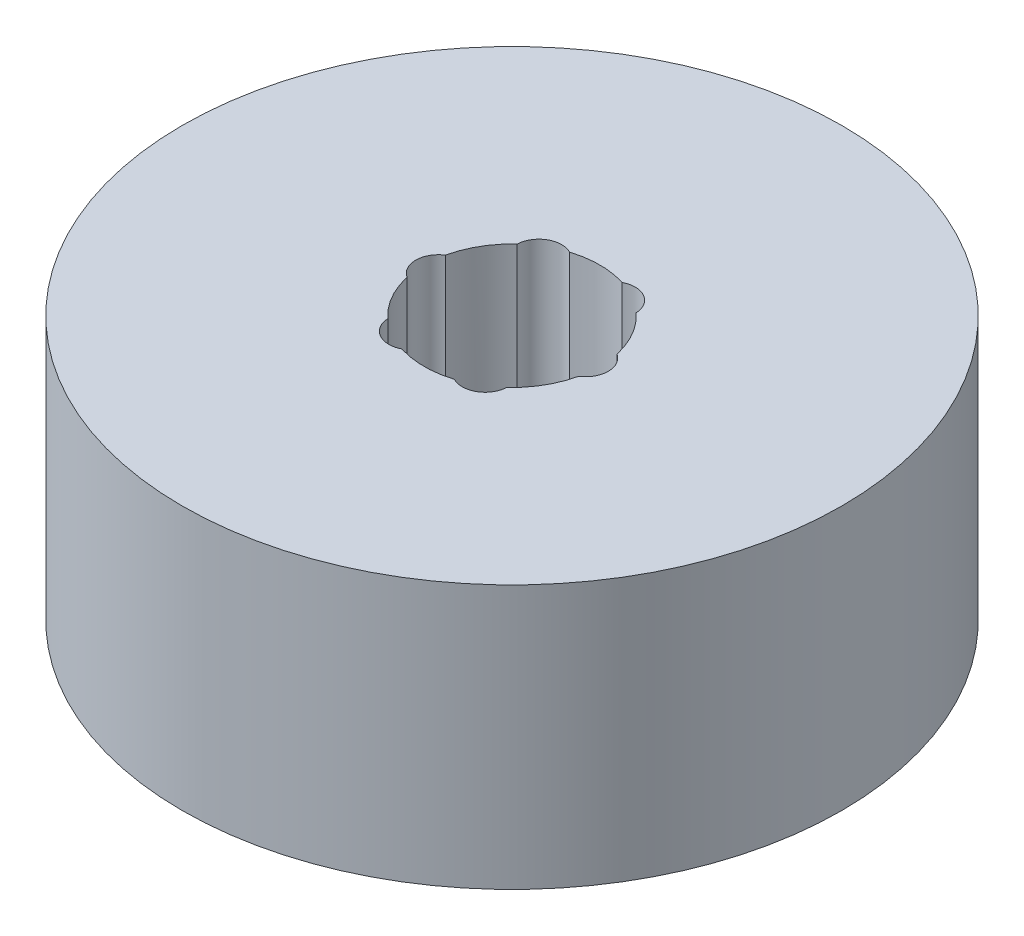
ISO-10303-21;
HEADER;
FILE_DESCRIPTION(('STEP AP214'),'2;1');
FILE_NAME('part.step','',(''),(''),'','','');
FILE_SCHEMA(('AUTOMOTIVE_DESIGN { 1 0 10303 214 1 1 1 1 }'));
ENDSEC;
DATA;
#1=APPLICATION_CONTEXT('core data for automotive mechanical design processes');
#2=APPLICATION_PROTOCOL_DEFINITION('international standard','automotive_design',2000,#1);
#3=PRODUCT_CONTEXT('',#1,'mechanical');
#4=PRODUCT('Part','Part','',(#3));
#5=PRODUCT_RELATED_PRODUCT_CATEGORY('part','',(#4));
#6=PRODUCT_DEFINITION_FORMATION('','',#4);
#7=PRODUCT_DEFINITION_CONTEXT('part definition',#1,'design');
#8=PRODUCT_DEFINITION('design','',#6,#7);
#9=PRODUCT_DEFINITION_SHAPE('','',#8);
#10=(LENGTH_UNIT() NAMED_UNIT(*) SI_UNIT(.MILLI.,.METRE.));
#11=(NAMED_UNIT(*) PLANE_ANGLE_UNIT() SI_UNIT($,.RADIAN.));
#12=(NAMED_UNIT(*) SI_UNIT($,.STERADIAN.) SOLID_ANGLE_UNIT());
#13=UNCERTAINTY_MEASURE_WITH_UNIT(LENGTH_MEASURE(1.E-05),#10,'distance_accuracy_value','');
#14=(GEOMETRIC_REPRESENTATION_CONTEXT(3) GLOBAL_UNCERTAINTY_ASSIGNED_CONTEXT((#13)) GLOBAL_UNIT_ASSIGNED_CONTEXT((#10,
#11,#12)) REPRESENTATION_CONTEXT('',''));
#15=CARTESIAN_POINT('',(0.,0.,0.));
#16=DIRECTION('',(0.,0.,1.));
#17=DIRECTION('',(1.,0.,0.));
#18=AXIS2_PLACEMENT_3D('',#15,#16,#17);
#19=CARTESIAN_POINT('',(0.,30.,0.));
#20=DIRECTION('',(0.,-1.,0.));
#21=DIRECTION('',(0.,0.,-1.));
#22=AXIS2_PLACEMENT_3D('',#19,#20,#21);
#23=CYLINDRICAL_SURFACE('',#22,37.5);
#24=CARTESIAN_POINT('',(0.,30.,0.));
#25=DIRECTION('',(0.,1.,0.));
#26=DIRECTION('',(0.,0.,1.));
#27=AXIS2_PLACEMENT_3D('',#24,#25,#26);
#28=CIRCLE('',#27,37.5);
#29=CARTESIAN_POINT('',(0.,30.,37.5));
#30=VERTEX_POINT('',#29);
#31=EDGE_CURVE('E162',#30,#30,#28,.T.);
#32=ORIENTED_EDGE('',*,*,#31,.F.);
#33=EDGE_LOOP('',(#32));
#34=FACE_BOUND('',#33,.T.);
#35=CARTESIAN_POINT('',(0.,0.,0.));
#36=DIRECTION('',(0.,1.,0.));
#37=DIRECTION('',(0.,0.,1.));
#38=AXIS2_PLACEMENT_3D('',#35,#36,#37);
#39=CIRCLE('',#38,37.5);
#40=CARTESIAN_POINT('',(0.,0.,37.5));
#41=VERTEX_POINT('',#40);
#42=EDGE_CURVE('E157',#41,#41,#39,.T.);
#43=ORIENTED_EDGE('',*,*,#42,.T.);
#44=EDGE_LOOP('',(#43));
#45=FACE_BOUND('',#44,.T.);
#46=ADVANCED_FACE('F39',(#34,#45),#23,.T.);
#47=CARTESIAN_POINT('',(0.,30.,0.));
#48=DIRECTION('',(0.,1.,0.));
#49=DIRECTION('',(0.,0.,1.));
#50=AXIS2_PLACEMENT_3D('',#47,#48,#49);
#51=PLANE('',#50);
#52=CARTESIAN_POINT('',(-4.18295327338985,30.,-7.24508759519758));
#53=DIRECTION('',(0.,1.,0.));
#54=DIRECTION('',(-0.866025403784433,0.,0.50000000000001));
#55=AXIS2_PLACEMENT_3D('',#52,#53,#54);
#56=CIRCLE('',#55,2.58696049097708);
#57=CARTESIAN_POINT('',(-2.99235889288839,30.,-9.54179166908143));
#58=VERTEX_POINT('',#57);
#59=CARTESIAN_POINT('',(-6.76725453659922,30.,-7.36235465302218));
#60=VERTEX_POINT('',#59);
#61=EDGE_CURVE('E218',#58,#60,#56,.T.);
#62=ORIENTED_EDGE('',*,*,#61,.F.);
#63=CARTESIAN_POINT('',(0.,30.,0.));
#64=DIRECTION('',(0.,1.,0.));
#65=DIRECTION('',(0.,0.,1.));
#66=AXIS2_PLACEMENT_3D('',#63,#64,#65);
#67=CIRCLE('',#66,10.);
#68=CARTESIAN_POINT('',(2.99235889288819,30.,-9.54179166908149));
#69=VERTEX_POINT('',#68);
#70=EDGE_CURVE('E169',#69,#58,#67,.T.);
#71=ORIENTED_EDGE('',*,*,#70,.F.);
#72=CARTESIAN_POINT('',(4.1829532733897,30.,-7.24508759519767));
#73=DIRECTION('',(0.,1.,0.));
#74=DIRECTION('',(-0.866025403784443,0.,-0.499999999999992));
#75=AXIS2_PLACEMENT_3D('',#72,#73,#74);
#76=CIRCLE('',#75,2.58696049097708);
#77=CARTESIAN_POINT('',(6.76725453659906,30.,-7.36235465302232));
#78=VERTEX_POINT('',#77);
#79=EDGE_CURVE('E285',#78,#69,#76,.T.);
#80=ORIENTED_EDGE('',*,*,#79,.F.);
#81=CARTESIAN_POINT('',(9.75961342948741,30.,-2.17943701605921));
#82=VERTEX_POINT('',#81);
#83=EDGE_CURVE('E174',#82,#78,#67,.T.);
#84=ORIENTED_EDGE('',*,*,#83,.F.);
#85=CARTESIAN_POINT('',(8.36590654677954,30.,0.));
#86=DIRECTION('',(0.,1.,0.));
#87=DIRECTION('',(0.,0.,-1.));
#88=AXIS2_PLACEMENT_3D('',#85,#86,#87);
#89=CIRCLE('',#88,2.58696049097708);
#90=CARTESIAN_POINT('',(9.75961342948741,30.,2.17943701605921));
#91=VERTEX_POINT('',#90);
#92=EDGE_CURVE('E280',#91,#82,#89,.T.);
#93=ORIENTED_EDGE('',*,*,#92,.F.);
#94=CARTESIAN_POINT('',(6.76725453659917,30.,7.36235465302223));
#95=VERTEX_POINT('',#94);
#96=EDGE_CURVE('E164',#95,#91,#67,.T.);
#97=ORIENTED_EDGE('',*,*,#96,.F.);
#98=CARTESIAN_POINT('',(4.1829532733898,30.,7.24508759519761));
#99=DIRECTION('',(0.,1.,0.));
#100=DIRECTION('',(0.866025403784436,0.,-0.500000000000004));
#101=AXIS2_PLACEMENT_3D('',#98,#99,#100);
#102=CIRCLE('',#101,2.58696049097708);
#103=CARTESIAN_POINT('',(2.99235889288832,30.,9.54179166908145));
#104=VERTEX_POINT('',#103);
#105=EDGE_CURVE('E269',#104,#95,#102,.T.);
#106=ORIENTED_EDGE('',*,*,#105,.F.);
#107=CARTESIAN_POINT('',(-2.99235889288825,30.,9.54179166908147));
#108=VERTEX_POINT('',#107);
#109=EDGE_CURVE('E149',#108,#104,#67,.T.);
#110=ORIENTED_EDGE('',*,*,#109,.F.);
#111=CARTESIAN_POINT('',(-4.18295327338975,30.,7.24508759519764));
#112=DIRECTION('',(0.,1.,0.));
#113=DIRECTION('',(0.86602540378444,0.,0.499999999999998));
#114=AXIS2_PLACEMENT_3D('',#111,#112,#113);
#115=CIRCLE('',#114,2.58696049097708);
#116=CARTESIAN_POINT('',(-6.76725453659911,30.,7.36235465302227));
#117=VERTEX_POINT('',#116);
#118=EDGE_CURVE('E128',#117,#108,#115,.T.);
#119=ORIENTED_EDGE('',*,*,#118,.F.);
#120=CARTESIAN_POINT('',(-9.75961342948741,30.,2.17943701605921));
#121=VERTEX_POINT('',#120);
#122=EDGE_CURVE('E148',#121,#117,#67,.T.);
#123=ORIENTED_EDGE('',*,*,#122,.F.);
#124=CARTESIAN_POINT('',(-8.36590654677954,30.,0.));
#125=DIRECTION('',(0.,1.,0.));
#126=DIRECTION('',(0.,0.,1.));
#127=AXIS2_PLACEMENT_3D('',#124,#125,#126);
#128=CIRCLE('',#127,2.58696049097708);
#129=CARTESIAN_POINT('',(-9.75961342948741,30.,-2.17943701605921));
#130=VERTEX_POINT('',#129);
#131=EDGE_CURVE('E179',#130,#121,#128,.T.);
#132=ORIENTED_EDGE('',*,*,#131,.F.);
#133=EDGE_CURVE('E161',#60,#130,#67,.T.);
#134=ORIENTED_EDGE('',*,*,#133,.F.);
#135=EDGE_LOOP('',(#62,#71,#80,#84,#93,#97,#106,#110,#119,#123,#132,#134));
#136=FACE_BOUND('',#135,.T.);
#137=ORIENTED_EDGE('',*,*,#31,.T.);
#138=EDGE_LOOP('',(#137));
#139=FACE_BOUND('',#138,.T.);
#140=ADVANCED_FACE('F141',(#136,#139),#51,.T.);
#141=CARTESIAN_POINT('',(0.,0.,0.));
#142=DIRECTION('',(0.,1.,0.));
#143=DIRECTION('',(0.,0.,1.));
#144=AXIS2_PLACEMENT_3D('',#141,#142,#143);
#145=PLANE('',#144);
#146=CARTESIAN_POINT('',(0.,0.,0.));
#147=DIRECTION('',(0.,1.,0.));
#148=DIRECTION('',(0.,0.,1.));
#149=AXIS2_PLACEMENT_3D('',#146,#147,#148);
#150=CIRCLE('',#149,10.);
#151=CARTESIAN_POINT('',(0.,0.,10.));
#152=VERTEX_POINT('',#151);
#153=EDGE_CURVE('E166',#152,#152,#150,.T.);
#154=ORIENTED_EDGE('',*,*,#153,.T.);
#155=EDGE_LOOP('',(#154));
#156=FACE_BOUND('',#155,.T.);
#157=ORIENTED_EDGE('',*,*,#42,.F.);
#158=EDGE_LOOP('',(#157));
#159=FACE_BOUND('',#158,.T.);
#160=ADVANCED_FACE('F234',(#156,#159),#145,.F.);
#161=CARTESIAN_POINT('',(0.,30.,0.));
#162=DIRECTION('',(0.,-1.,0.));
#163=DIRECTION('',(0.,0.,-1.));
#164=AXIS2_PLACEMENT_3D('',#161,#162,#163);
#165=CYLINDRICAL_SURFACE('',#164,10.);
#166=DIRECTION('',(0.,1.,0.));
#167=VECTOR('',#166,1.);
#168=CARTESIAN_POINT('',(-2.99235889288839,19.5726426997679,-9.54179166908143));
#169=LINE('',#168,#167);
#170=CARTESIAN_POINT('',(-2.99235889288839,9.14528539953572,-9.54179166908143));
#171=VERTEX_POINT('',#170);
#172=EDGE_CURVE('E11',#171,#58,#169,.T.);
#173=ORIENTED_EDGE('',*,*,#172,.F.);
#174=CARTESIAN_POINT('',(0.,9.14528539953572,0.));
#175=DIRECTION('',(0.,1.,0.));
#176=DIRECTION('',(0.,0.,1.));
#177=AXIS2_PLACEMENT_3D('',#174,#175,#176);
#178=CIRCLE('',#177,10.);
#179=CARTESIAN_POINT('',(-6.76725453659922,9.14528539953572,-7.36235465302218));
#180=VERTEX_POINT('',#179);
#181=EDGE_CURVE('E214',#171,#180,#178,.T.);
#182=ORIENTED_EDGE('',*,*,#181,.T.);
#183=DIRECTION('',(0.,1.,0.));
#184=VECTOR('',#183,1.);
#185=CARTESIAN_POINT('',(-6.76725453659922,19.5726426997679,-7.36235465302218));
#186=LINE('',#185,#184);
#187=EDGE_CURVE('E46',#60,#180,#186,.F.);
#188=ORIENTED_EDGE('',*,*,#187,.F.);
#189=ORIENTED_EDGE('',*,*,#133,.T.);
#190=DIRECTION('',(0.,1.,0.));
#191=VECTOR('',#190,1.);
#192=CARTESIAN_POINT('',(-9.75961342948741,19.5726426997679,-2.17943701605921));
#193=LINE('',#192,#191);
#194=CARTESIAN_POINT('',(-9.75961342948741,9.14528539953572,-2.17943701605921));
#195=VERTEX_POINT('',#194);
#196=EDGE_CURVE('E187',#195,#130,#193,.T.);
#197=ORIENTED_EDGE('',*,*,#196,.F.);
#198=CARTESIAN_POINT('',(0.,9.14528539953572,0.));
#199=DIRECTION('',(0.,1.,0.));
#200=DIRECTION('',(0.,0.,1.));
#201=AXIS2_PLACEMENT_3D('',#198,#199,#200);
#202=CIRCLE('',#201,10.);
#203=CARTESIAN_POINT('',(-9.75961342948741,9.14528539953572,2.17943701605921));
#204=VERTEX_POINT('',#203);
#205=EDGE_CURVE('E184',#195,#204,#202,.T.);
#206=ORIENTED_EDGE('',*,*,#205,.T.);
#207=DIRECTION('',(0.,1.,0.));
#208=VECTOR('',#207,1.);
#209=CARTESIAN_POINT('',(-9.75961342948741,19.5726426997679,2.17943701605921));
#210=LINE('',#209,#208);
#211=EDGE_CURVE('E158',#121,#204,#210,.F.);
#212=ORIENTED_EDGE('',*,*,#211,.F.);
#213=ORIENTED_EDGE('',*,*,#122,.T.);
#214=DIRECTION('',(0.,1.,0.));
#215=VECTOR('',#214,1.);
#216=CARTESIAN_POINT('',(-6.76725453659911,19.5726426997679,7.36235465302228));
#217=LINE('',#216,#215);
#218=CARTESIAN_POINT('',(-6.76725453659911,9.14528539953572,7.36235465302227));
#219=VERTEX_POINT('',#218);
#220=EDGE_CURVE('E127',#219,#117,#217,.T.);
#221=ORIENTED_EDGE('',*,*,#220,.F.);
#222=CARTESIAN_POINT('',(0.,9.14528539953572,0.));
#223=DIRECTION('',(0.,1.,0.));
#224=DIRECTION('',(0.,0.,1.));
#225=AXIS2_PLACEMENT_3D('',#222,#223,#224);
#226=CIRCLE('',#225,10.);
#227=CARTESIAN_POINT('',(-2.99235889288825,9.14528539953572,9.54179166908147));
#228=VERTEX_POINT('',#227);
#229=EDGE_CURVE('E189',#219,#228,#226,.T.);
#230=ORIENTED_EDGE('',*,*,#229,.T.);
#231=DIRECTION('',(0.,1.,0.));
#232=VECTOR('',#231,1.);
#233=CARTESIAN_POINT('',(-2.99235889288826,19.5726426997679,9.54179166908147));
#234=LINE('',#233,#232);
#235=EDGE_CURVE('E140',#108,#228,#234,.F.);
#236=ORIENTED_EDGE('',*,*,#235,.F.);
#237=ORIENTED_EDGE('',*,*,#109,.T.);
#238=DIRECTION('',(0.,1.,0.));
#239=VECTOR('',#238,1.);
#240=CARTESIAN_POINT('',(2.99235889288832,19.5726426997679,9.54179166908146));
#241=LINE('',#240,#239);
#242=CARTESIAN_POINT('',(2.99235889288832,9.14528539953572,9.54179166908145));
#243=VERTEX_POINT('',#242);
#244=EDGE_CURVE('E196',#243,#104,#241,.T.);
#245=ORIENTED_EDGE('',*,*,#244,.F.);
#246=CARTESIAN_POINT('',(0.,9.14528539953572,0.));
#247=DIRECTION('',(0.,1.,0.));
#248=DIRECTION('',(0.,0.,1.));
#249=AXIS2_PLACEMENT_3D('',#246,#247,#248);
#250=CIRCLE('',#249,10.);
#251=CARTESIAN_POINT('',(6.76725453659917,9.14528539953572,7.36235465302223));
#252=VERTEX_POINT('',#251);
#253=EDGE_CURVE('E136',#243,#252,#250,.T.);
#254=ORIENTED_EDGE('',*,*,#253,.T.);
#255=DIRECTION('',(0.,1.,0.));
#256=VECTOR('',#255,1.);
#257=CARTESIAN_POINT('',(6.76725453659917,19.5726426997679,7.36235465302223));
#258=LINE('',#257,#256);
#259=EDGE_CURVE('E194',#95,#252,#258,.F.);
#260=ORIENTED_EDGE('',*,*,#259,.F.);
#261=ORIENTED_EDGE('',*,*,#96,.T.);
#262=DIRECTION('',(0.,1.,0.));
#263=VECTOR('',#262,1.);
#264=CARTESIAN_POINT('',(9.75961342948741,19.5726426997679,2.17943701605921));
#265=LINE('',#264,#263);
#266=CARTESIAN_POINT('',(9.75961342948741,9.14528539953572,2.17943701605921));
#267=VERTEX_POINT('',#266);
#268=EDGE_CURVE('E206',#267,#91,#265,.T.);
#269=ORIENTED_EDGE('',*,*,#268,.F.);
#270=CARTESIAN_POINT('',(0.,9.14528539953572,0.));
#271=DIRECTION('',(0.,1.,0.));
#272=DIRECTION('',(0.,0.,1.));
#273=AXIS2_PLACEMENT_3D('',#270,#271,#272);
#274=CIRCLE('',#273,10.);
#275=CARTESIAN_POINT('',(9.75961342948741,9.14528539953572,-2.17943701605921));
#276=VERTEX_POINT('',#275);
#277=EDGE_CURVE('E199',#267,#276,#274,.T.);
#278=ORIENTED_EDGE('',*,*,#277,.T.);
#279=DIRECTION('',(0.,1.,0.));
#280=VECTOR('',#279,1.);
#281=CARTESIAN_POINT('',(9.75961342948741,19.5726426997679,-2.17943701605921));
#282=LINE('',#281,#280);
#283=EDGE_CURVE('E201',#82,#276,#282,.F.);
#284=ORIENTED_EDGE('',*,*,#283,.F.);
#285=ORIENTED_EDGE('',*,*,#83,.T.);
#286=DIRECTION('',(0.,1.,0.));
#287=VECTOR('',#286,1.);
#288=CARTESIAN_POINT('',(6.76725453659906,19.5726426997679,-7.36235465302232));
#289=LINE('',#288,#287);
#290=CARTESIAN_POINT('',(6.76725453659906,9.14528539953572,-7.36235465302232));
#291=VERTEX_POINT('',#290);
#292=EDGE_CURVE('E213',#291,#78,#289,.T.);
#293=ORIENTED_EDGE('',*,*,#292,.F.);
#294=CARTESIAN_POINT('',(0.,9.14528539953572,0.));
#295=DIRECTION('',(0.,1.,0.));
#296=DIRECTION('',(0.,0.,1.));
#297=AXIS2_PLACEMENT_3D('',#294,#295,#296);
#298=CIRCLE('',#297,10.);
#299=CARTESIAN_POINT('',(2.99235889288819,9.14528539953572,-9.54179166908149));
#300=VERTEX_POINT('',#299);
#301=EDGE_CURVE('E208',#291,#300,#298,.T.);
#302=ORIENTED_EDGE('',*,*,#301,.T.);
#303=DIRECTION('',(0.,1.,0.));
#304=VECTOR('',#303,1.);
#305=CARTESIAN_POINT('',(2.99235889288819,19.5726426997679,-9.54179166908149));
#306=LINE('',#305,#304);
#307=EDGE_CURVE('E211',#69,#300,#306,.F.);
#308=ORIENTED_EDGE('',*,*,#307,.F.);
#309=ORIENTED_EDGE('',*,*,#70,.T.);
#310=EDGE_LOOP('',(#173,#182,#188,#189,#197,#206,#212,#213,#221,#230,#236,#237,#245,#254,#260,
#261,#269,#278,#284,#285,#293,#302,#308,#309));
#311=FACE_BOUND('',#310,.T.);
#312=ORIENTED_EDGE('',*,*,#153,.F.);
#313=EDGE_LOOP('',(#312));
#314=FACE_BOUND('',#313,.T.);
#315=ADVANCED_FACE('F152',(#311,#314),#165,.F.);
#316=CARTESIAN_POINT('',(-8.36590654677954,9.14528539953572,0.));
#317=DIRECTION('',(0.,1.,0.));
#318=DIRECTION('',(0.,0.,1.));
#319=AXIS2_PLACEMENT_3D('',#316,#317,#318);
#320=CYLINDRICAL_SURFACE('',#319,2.58696049097708);
#321=ORIENTED_EDGE('',*,*,#196,.T.);
#322=ORIENTED_EDGE('',*,*,#131,.T.);
#323=ORIENTED_EDGE('',*,*,#211,.T.);
#324=CARTESIAN_POINT('',(-8.36590654677954,9.14528539953572,0.));
#325=DIRECTION('',(0.,1.,0.));
#326=DIRECTION('',(0.,0.,1.));
#327=AXIS2_PLACEMENT_3D('',#324,#325,#326);
#328=CIRCLE('',#327,2.58696049097708);
#329=EDGE_CURVE('E180',#195,#204,#328,.T.);
#330=ORIENTED_EDGE('',*,*,#329,.F.);
#331=EDGE_LOOP('',(#321,#322,#323,#330));
#332=FACE_BOUND('',#331,.T.);
#333=ADVANCED_FACE('F244',(#332),#320,.F.);
#334=CARTESIAN_POINT('',(-8.36590654677954,9.14528539953572,0.));
#335=DIRECTION('',(0.,1.,0.));
#336=DIRECTION('',(0.,0.,1.));
#337=AXIS2_PLACEMENT_3D('',#334,#335,#336);
#338=PLANE('',#337);
#339=ORIENTED_EDGE('',*,*,#329,.T.);
#340=ORIENTED_EDGE('',*,*,#205,.F.);
#341=EDGE_LOOP('',(#339,#340));
#342=FACE_BOUND('',#341,.T.);
#343=ADVANCED_FACE('F248',(#342),#338,.T.);
#344=CARTESIAN_POINT('',(-4.18295327338975,9.14528539953572,7.24508759519764));
#345=DIRECTION('',(0.,1.,0.));
#346=DIRECTION('',(0.,0.,1.));
#347=AXIS2_PLACEMENT_3D('',#344,#345,#346);
#348=CYLINDRICAL_SURFACE('',#347,2.58696049097708);
#349=ORIENTED_EDGE('',*,*,#220,.T.);
#350=ORIENTED_EDGE('',*,*,#118,.T.);
#351=ORIENTED_EDGE('',*,*,#235,.T.);
#352=CARTESIAN_POINT('',(-4.18295327338975,9.14528539953572,7.24508759519764));
#353=DIRECTION('',(0.,1.,0.));
#354=DIRECTION('',(0.86602540378444,0.,0.499999999999998));
#355=AXIS2_PLACEMENT_3D('',#352,#353,#354);
#356=CIRCLE('',#355,2.58696049097708);
#357=EDGE_CURVE('E135',#219,#228,#356,.T.);
#358=ORIENTED_EDGE('',*,*,#357,.F.);
#359=EDGE_LOOP('',(#349,#350,#351,#358));
#360=FACE_BOUND('',#359,.T.);
#361=ADVANCED_FACE('F126',(#360),#348,.F.);
#362=CARTESIAN_POINT('',(-4.18295327338975,9.14528539953572,7.24508759519764));
#363=DIRECTION('',(0.,1.,0.));
#364=DIRECTION('',(0.86602540378444,0.,0.499999999999998));
#365=AXIS2_PLACEMENT_3D('',#362,#363,#364);
#366=PLANE('',#365);
#367=ORIENTED_EDGE('',*,*,#357,.T.);
#368=ORIENTED_EDGE('',*,*,#229,.F.);
#369=EDGE_LOOP('',(#367,#368));
#370=FACE_BOUND('',#369,.T.);
#371=ADVANCED_FACE('F258',(#370),#366,.T.);
#372=CARTESIAN_POINT('',(4.1829532733898,9.14528539953572,7.24508759519761));
#373=DIRECTION('',(0.,1.,0.));
#374=DIRECTION('',(0.,0.,1.));
#375=AXIS2_PLACEMENT_3D('',#372,#373,#374);
#376=CYLINDRICAL_SURFACE('',#375,2.58696049097708);
#377=ORIENTED_EDGE('',*,*,#244,.T.);
#378=ORIENTED_EDGE('',*,*,#105,.T.);
#379=ORIENTED_EDGE('',*,*,#259,.T.);
#380=CARTESIAN_POINT('',(4.1829532733898,9.14528539953572,7.24508759519761));
#381=DIRECTION('',(0.,1.,0.));
#382=DIRECTION('',(0.866025403784436,0.,-0.500000000000004));
#383=AXIS2_PLACEMENT_3D('',#380,#381,#382);
#384=CIRCLE('',#383,2.58696049097708);
#385=EDGE_CURVE('E147',#243,#252,#384,.T.);
#386=ORIENTED_EDGE('',*,*,#385,.F.);
#387=EDGE_LOOP('',(#377,#378,#379,#386));
#388=FACE_BOUND('',#387,.T.);
#389=ADVANCED_FACE('F256',(#388),#376,.F.);
#390=CARTESIAN_POINT('',(4.1829532733898,9.14528539953572,7.24508759519761));
#391=DIRECTION('',(0.,1.,0.));
#392=DIRECTION('',(0.866025403784436,0.,-0.500000000000004));
#393=AXIS2_PLACEMENT_3D('',#390,#391,#392);
#394=PLANE('',#393);
#395=ORIENTED_EDGE('',*,*,#385,.T.);
#396=ORIENTED_EDGE('',*,*,#253,.F.);
#397=EDGE_LOOP('',(#395,#396));
#398=FACE_BOUND('',#397,.T.);
#399=ADVANCED_FACE('F263',(#398),#394,.T.);
#400=CARTESIAN_POINT('',(8.36590654677954,9.14528539953572,0.));
#401=DIRECTION('',(0.,1.,0.));
#402=DIRECTION('',(0.,0.,1.));
#403=AXIS2_PLACEMENT_3D('',#400,#401,#402);
#404=CYLINDRICAL_SURFACE('',#403,2.58696049097708);
#405=ORIENTED_EDGE('',*,*,#268,.T.);
#406=ORIENTED_EDGE('',*,*,#92,.T.);
#407=ORIENTED_EDGE('',*,*,#283,.T.);
#408=CARTESIAN_POINT('',(8.36590654677954,9.14528539953572,0.));
#409=DIRECTION('',(0.,1.,0.));
#410=DIRECTION('',(0.,0.,-1.));
#411=AXIS2_PLACEMENT_3D('',#408,#409,#410);
#412=CIRCLE('',#411,2.58696049097708);
#413=EDGE_CURVE('E273',#267,#276,#412,.T.);
#414=ORIENTED_EDGE('',*,*,#413,.F.);
#415=EDGE_LOOP('',(#405,#406,#407,#414));
#416=FACE_BOUND('',#415,.T.);
#417=ADVANCED_FACE('F297',(#416),#404,.F.);
#418=CARTESIAN_POINT('',(8.36590654677954,9.14528539953572,0.));
#419=DIRECTION('',(0.,1.,0.));
#420=DIRECTION('',(0.,0.,-1.));
#421=AXIS2_PLACEMENT_3D('',#418,#419,#420);
#422=PLANE('',#421);
#423=ORIENTED_EDGE('',*,*,#413,.T.);
#424=ORIENTED_EDGE('',*,*,#277,.F.);
#425=EDGE_LOOP('',(#423,#424));
#426=FACE_BOUND('',#425,.T.);
#427=ADVANCED_FACE('F299',(#426),#422,.T.);
#428=CARTESIAN_POINT('',(4.1829532733897,9.14528539953572,-7.24508759519767));
#429=DIRECTION('',(0.,1.,0.));
#430=DIRECTION('',(0.,0.,1.));
#431=AXIS2_PLACEMENT_3D('',#428,#429,#430);
#432=CYLINDRICAL_SURFACE('',#431,2.58696049097708);
#433=ORIENTED_EDGE('',*,*,#292,.T.);
#434=ORIENTED_EDGE('',*,*,#79,.T.);
#435=ORIENTED_EDGE('',*,*,#307,.T.);
#436=CARTESIAN_POINT('',(4.1829532733897,9.14528539953572,-7.24508759519767));
#437=DIRECTION('',(0.,1.,0.));
#438=DIRECTION('',(-0.866025403784443,0.,-0.499999999999992));
#439=AXIS2_PLACEMENT_3D('',#436,#437,#438);
#440=CIRCLE('',#439,2.58696049097708);
#441=EDGE_CURVE('E56',#291,#300,#440,.T.);
#442=ORIENTED_EDGE('',*,*,#441,.F.);
#443=EDGE_LOOP('',(#433,#434,#435,#442));
#444=FACE_BOUND('',#443,.T.);
#445=ADVANCED_FACE('F292',(#444),#432,.F.);
#446=CARTESIAN_POINT('',(4.1829532733897,9.14528539953572,-7.24508759519767));
#447=DIRECTION('',(0.,1.,0.));
#448=DIRECTION('',(-0.866025403784443,0.,-0.499999999999992));
#449=AXIS2_PLACEMENT_3D('',#446,#447,#448);
#450=PLANE('',#449);
#451=ORIENTED_EDGE('',*,*,#441,.T.);
#452=ORIENTED_EDGE('',*,*,#301,.F.);
#453=EDGE_LOOP('',(#451,#452));
#454=FACE_BOUND('',#453,.T.);
#455=ADVANCED_FACE('F226',(#454),#450,.T.);
#456=CARTESIAN_POINT('',(-4.18295327338985,9.14528539953572,-7.24508759519758));
#457=DIRECTION('',(0.,1.,0.));
#458=DIRECTION('',(0.,0.,1.));
#459=AXIS2_PLACEMENT_3D('',#456,#457,#458);
#460=CYLINDRICAL_SURFACE('',#459,2.58696049097708);
#461=ORIENTED_EDGE('',*,*,#172,.T.);
#462=ORIENTED_EDGE('',*,*,#61,.T.);
#463=ORIENTED_EDGE('',*,*,#187,.T.);
#464=CARTESIAN_POINT('',(-4.18295327338985,9.14528539953572,-7.24508759519758));
#465=DIRECTION('',(0.,1.,0.));
#466=DIRECTION('',(-0.866025403784433,0.,0.50000000000001));
#467=AXIS2_PLACEMENT_3D('',#464,#465,#466);
#468=CIRCLE('',#467,2.58696049097708);
#469=EDGE_CURVE('E55',#171,#180,#468,.T.);
#470=ORIENTED_EDGE('',*,*,#469,.F.);
#471=EDGE_LOOP('',(#461,#462,#463,#470));
#472=FACE_BOUND('',#471,.T.);
#473=ADVANCED_FACE('F217',(#472),#460,.F.);
#474=CARTESIAN_POINT('',(-4.18295327338985,9.14528539953572,-7.24508759519758));
#475=DIRECTION('',(0.,1.,0.));
#476=DIRECTION('',(-0.866025403784433,0.,0.50000000000001));
#477=AXIS2_PLACEMENT_3D('',#474,#475,#476);
#478=PLANE('',#477);
#479=ORIENTED_EDGE('',*,*,#469,.T.);
#480=ORIENTED_EDGE('',*,*,#181,.F.);
#481=EDGE_LOOP('',(#479,#480));
#482=FACE_BOUND('',#481,.T.);
#483=ADVANCED_FACE('F219',(#482),#478,.T.);
#484=CLOSED_SHELL('',(#46,#140,#160,#315,#333,#343,#361,#371,#389,#399,#417,#427,#445,#455,#473,#483));
#485=MANIFOLD_SOLID_BREP('B2',#484);
#486=ADVANCED_BREP_SHAPE_REPRESENTATION('',(#18,#485),#14);
#487=SHAPE_DEFINITION_REPRESENTATION(#9,#486);
ENDSEC;
END-ISO-10303-21;
